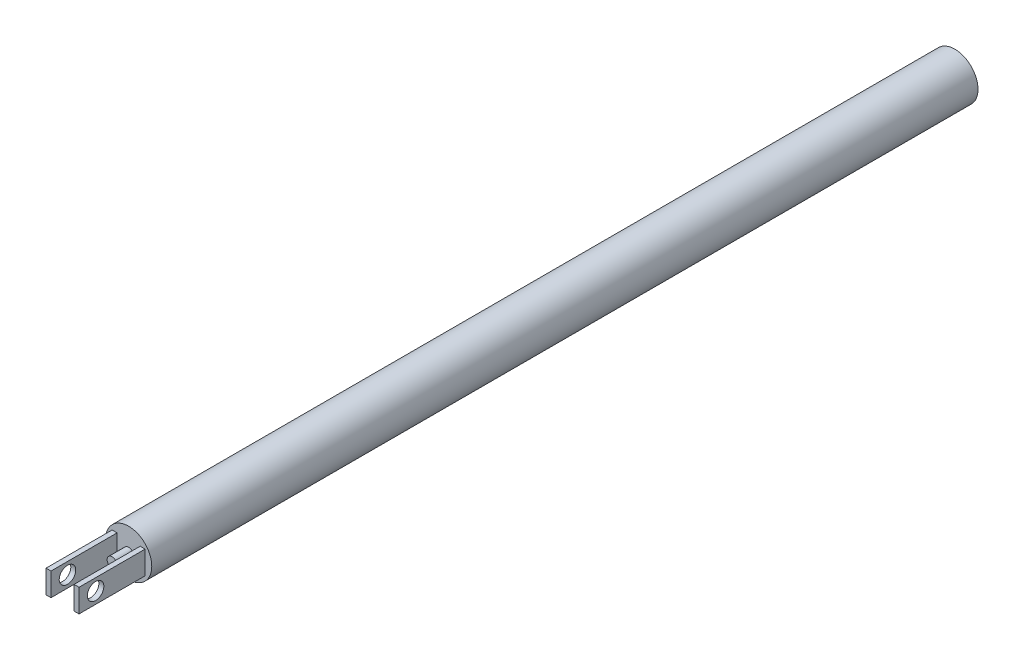
ISO-10303-21;
HEADER;
FILE_DESCRIPTION(('STEP AP214'),'2;1');
FILE_NAME('part.step','',(''),(''),'','','');
FILE_SCHEMA(('AUTOMOTIVE_DESIGN { 1 0 10303 214 1 1 1 1 }'));
ENDSEC;
DATA;
#1=APPLICATION_CONTEXT('core data for automotive mechanical design processes');
#2=APPLICATION_PROTOCOL_DEFINITION('international standard','automotive_design',2000,#1);
#3=PRODUCT_CONTEXT('',#1,'mechanical');
#4=PRODUCT('Part','Part','',(#3));
#5=PRODUCT_RELATED_PRODUCT_CATEGORY('part','',(#4));
#6=PRODUCT_DEFINITION_FORMATION('','',#4);
#7=PRODUCT_DEFINITION_CONTEXT('part definition',#1,'design');
#8=PRODUCT_DEFINITION('design','',#6,#7);
#9=PRODUCT_DEFINITION_SHAPE('','',#8);
#10=(LENGTH_UNIT() NAMED_UNIT(*) SI_UNIT(.MILLI.,.METRE.));
#11=(NAMED_UNIT(*) PLANE_ANGLE_UNIT() SI_UNIT($,.RADIAN.));
#12=(NAMED_UNIT(*) SI_UNIT($,.STERADIAN.) SOLID_ANGLE_UNIT());
#13=UNCERTAINTY_MEASURE_WITH_UNIT(LENGTH_MEASURE(1.E-05),#10,'distance_accuracy_value','');
#14=(GEOMETRIC_REPRESENTATION_CONTEXT(3) GLOBAL_UNCERTAINTY_ASSIGNED_CONTEXT((#13)) GLOBAL_UNIT_ASSIGNED_CONTEXT((#10,
#11,#12)) REPRESENTATION_CONTEXT('',''));
#15=CARTESIAN_POINT('',(0.,0.,0.));
#16=DIRECTION('',(0.,0.,1.));
#17=DIRECTION('',(1.,0.,0.));
#18=AXIS2_PLACEMENT_3D('',#15,#16,#17);
#19=CARTESIAN_POINT('',(-5.,-3.5,145.));
#20=DIRECTION('',(0.,0.,1.));
#21=DIRECTION('',(1.,0.,0.));
#22=AXIS2_PLACEMENT_3D('',#19,#20,#21);
#23=PLANE('',#22);
#24=DIRECTION('',(0.,1.,0.));
#25=VECTOR('',#24,1.);
#26=CARTESIAN_POINT('',(3.5,-3.5,145.));
#27=LINE('',#26,#25);
#28=CARTESIAN_POINT('',(3.5,-3.5,145.));
#29=VERTEX_POINT('',#28);
#30=CARTESIAN_POINT('',(3.5,3.5,145.));
#31=VERTEX_POINT('',#30);
#32=EDGE_CURVE('E101',#29,#31,#27,.T.);
#33=ORIENTED_EDGE('',*,*,#32,.F.);
#34=DIRECTION('',(1.,0.,0.));
#35=VECTOR('',#34,1.);
#36=CARTESIAN_POINT('',(-5.,-3.5,145.));
#37=LINE('',#36,#35);
#38=CARTESIAN_POINT('',(5.,-3.5,145.));
#39=VERTEX_POINT('',#38);
#40=EDGE_CURVE('E142',#29,#39,#37,.T.);
#41=ORIENTED_EDGE('',*,*,#40,.T.);
#42=DIRECTION('',(0.,-1.,0.));
#43=VECTOR('',#42,1.);
#44=CARTESIAN_POINT('',(5.,-3.5,145.));
#45=LINE('',#44,#43);
#46=CARTESIAN_POINT('',(5.,3.5,145.));
#47=VERTEX_POINT('',#46);
#48=EDGE_CURVE('E125',#47,#39,#45,.T.);
#49=ORIENTED_EDGE('',*,*,#48,.F.);
#50=DIRECTION('',(1.,0.,0.));
#51=VECTOR('',#50,1.);
#52=CARTESIAN_POINT('',(-5.,3.5,145.));
#53=LINE('',#52,#51);
#54=EDGE_CURVE('E118',#31,#47,#53,.T.);
#55=ORIENTED_EDGE('',*,*,#54,.F.);
#56=EDGE_LOOP('',(#33,#41,#49,#55));
#57=FACE_BOUND('',#56,.T.);
#58=ADVANCED_FACE('F33',(#57),#23,.T.);
#59=CARTESIAN_POINT('',(-5.,3.5,145.));
#60=DIRECTION('',(0.,1.,0.));
#61=DIRECTION('',(0.,0.,1.));
#62=AXIS2_PLACEMENT_3D('',#59,#60,#61);
#63=PLANE('',#62);
#64=DIRECTION('',(0.,0.,1.));
#65=VECTOR('',#64,1.);
#66=CARTESIAN_POINT('',(3.5,3.5,115.100505063388));
#67=LINE('',#66,#65);
#68=CARTESIAN_POINT('',(3.5,3.5,125.));
#69=VERTEX_POINT('',#68);
#70=EDGE_CURVE('E105',#69,#31,#67,.T.);
#71=ORIENTED_EDGE('',*,*,#70,.T.);
#72=ORIENTED_EDGE('',*,*,#54,.T.);
#73=DIRECTION('',(0.,0.,1.));
#74=VECTOR('',#73,1.);
#75=CARTESIAN_POINT('',(5.,3.5,145.));
#76=LINE('',#75,#74);
#77=CARTESIAN_POINT('',(5.,3.5,125.));
#78=VERTEX_POINT('',#77);
#79=EDGE_CURVE('E169',#78,#47,#76,.T.);
#80=ORIENTED_EDGE('',*,*,#79,.F.);
#81=DIRECTION('',(1.,0.,0.));
#82=VECTOR('',#81,1.);
#83=CARTESIAN_POINT('',(-5.,3.5,125.));
#84=LINE('',#83,#82);
#85=EDGE_CURVE('E120',#69,#78,#84,.T.);
#86=ORIENTED_EDGE('',*,*,#85,.F.);
#87=EDGE_LOOP('',(#71,#72,#80,#86));
#88=FACE_BOUND('',#87,.T.);
#89=ADVANCED_FACE('F116',(#88),#63,.T.);
#90=CARTESIAN_POINT('',(-5.,-3.5,145.));
#91=DIRECTION('',(0.,-1.,0.));
#92=DIRECTION('',(0.,0.,-1.));
#93=AXIS2_PLACEMENT_3D('',#90,#91,#92);
#94=PLANE('',#93);
#95=DIRECTION('',(0.,0.,1.));
#96=VECTOR('',#95,1.);
#97=CARTESIAN_POINT('',(3.5,-3.5,115.100505063388));
#98=LINE('',#97,#96);
#99=CARTESIAN_POINT('',(3.5,-3.5,125.));
#100=VERTEX_POINT('',#99);
#101=EDGE_CURVE('E108',#100,#29,#98,.T.);
#102=ORIENTED_EDGE('',*,*,#101,.F.);
#103=DIRECTION('',(1.,0.,0.));
#104=VECTOR('',#103,1.);
#105=CARTESIAN_POINT('',(-5.,-3.5,125.));
#106=LINE('',#105,#104);
#107=CARTESIAN_POINT('',(5.,-3.5,125.));
#108=VERTEX_POINT('',#107);
#109=EDGE_CURVE('E138',#100,#108,#106,.T.);
#110=ORIENTED_EDGE('',*,*,#109,.T.);
#111=DIRECTION('',(0.,0.,-1.));
#112=VECTOR('',#111,1.);
#113=CARTESIAN_POINT('',(5.,-3.5,145.));
#114=LINE('',#113,#112);
#115=EDGE_CURVE('E163',#39,#108,#114,.T.);
#116=ORIENTED_EDGE('',*,*,#115,.F.);
#117=ORIENTED_EDGE('',*,*,#40,.F.);
#118=EDGE_LOOP('',(#102,#110,#116,#117));
#119=FACE_BOUND('',#118,.T.);
#120=ADVANCED_FACE('F186',(#119),#94,.T.);
#121=CARTESIAN_POINT('',(-5.,0.,140.));
#122=DIRECTION('',(1.,0.,0.));
#123=DIRECTION('',(0.,0.,-1.));
#124=AXIS2_PLACEMENT_3D('',#121,#122,#123);
#125=CYLINDRICAL_SURFACE('',#124,2.5);
#126=CARTESIAN_POINT('',(3.5,0.,140.));
#127=DIRECTION('',(1.,0.,0.));
#128=DIRECTION('',(0.,0.,-1.));
#129=AXIS2_PLACEMENT_3D('',#126,#127,#128);
#130=CIRCLE('',#129,2.5);
#131=CARTESIAN_POINT('',(3.5,0.,137.5));
#132=VERTEX_POINT('',#131);
#133=EDGE_CURVE('E37',#132,#132,#130,.F.);
#134=ORIENTED_EDGE('',*,*,#133,.T.);
#135=EDGE_LOOP('',(#134));
#136=FACE_BOUND('',#135,.T.);
#137=CARTESIAN_POINT('',(5.,0.,140.));
#138=DIRECTION('',(1.,0.,0.));
#139=DIRECTION('',(0.,0.,-1.));
#140=AXIS2_PLACEMENT_3D('',#137,#138,#139);
#141=CIRCLE('',#140,2.5);
#142=CARTESIAN_POINT('',(5.,0.,137.5));
#143=VERTEX_POINT('',#142);
#144=EDGE_CURVE('E150',#143,#143,#141,.T.);
#145=ORIENTED_EDGE('',*,*,#144,.T.);
#146=EDGE_LOOP('',(#145));
#147=FACE_BOUND('',#146,.T.);
#148=ADVANCED_FACE('F196',(#136,#147),#125,.F.);
#149=CARTESIAN_POINT('',(0.,0.,125.));
#150=DIRECTION('',(0.,0.,1.));
#151=DIRECTION('',(1.,0.,0.));
#152=AXIS2_PLACEMENT_3D('',#149,#150,#151);
#153=PLANE('',#152);
#154=CARTESIAN_POINT('',(0.,0.,125.));
#155=DIRECTION('',(0.,0.,1.));
#156=DIRECTION('',(1.,0.,0.));
#157=AXIS2_PLACEMENT_3D('',#154,#155,#156);
#158=CIRCLE('',#157,1.5);
#159=CARTESIAN_POINT('',(1.5,0.,125.));
#160=VERTEX_POINT('',#159);
#161=EDGE_CURVE('E256',#160,#160,#158,.T.);
#162=ORIENTED_EDGE('',*,*,#161,.F.);
#163=EDGE_LOOP('',(#162));
#164=FACE_BOUND('',#163,.T.);
#165=DIRECTION('',(0.,-1.,0.));
#166=VECTOR('',#165,1.);
#167=CARTESIAN_POINT('',(3.5,-3.5,125.));
#168=LINE('',#167,#166);
#169=EDGE_CURVE('E146',#69,#100,#168,.T.);
#170=ORIENTED_EDGE('',*,*,#169,.F.);
#171=ORIENTED_EDGE('',*,*,#85,.T.);
#172=DIRECTION('',(0.,1.,0.));
#173=VECTOR('',#172,1.);
#174=CARTESIAN_POINT('',(5.,-3.5,125.));
#175=LINE('',#174,#173);
#176=EDGE_CURVE('E166',#108,#78,#175,.T.);
#177=ORIENTED_EDGE('',*,*,#176,.F.);
#178=ORIENTED_EDGE('',*,*,#109,.F.);
#179=EDGE_LOOP('',(#170,#171,#177,#178));
#180=FACE_BOUND('',#179,.T.);
#181=CARTESIAN_POINT('',(0.,0.,125.));
#182=DIRECTION('',(0.,0.,1.));
#183=DIRECTION('',(1.,0.,0.));
#184=AXIS2_PLACEMENT_3D('',#181,#182,#183);
#185=CIRCLE('',#184,7.);
#186=CARTESIAN_POINT('',(7.,0.,125.));
#187=VERTEX_POINT('',#186);
#188=EDGE_CURVE('E42',#187,#187,#185,.T.);
#189=ORIENTED_EDGE('',*,*,#188,.T.);
#190=EDGE_LOOP('',(#189));
#191=FACE_BOUND('',#190,.T.);
#192=DIRECTION('',(0.,1.,0.));
#193=VECTOR('',#192,1.);
#194=CARTESIAN_POINT('',(-5.,-3.5,125.));
#195=LINE('',#194,#193);
#196=CARTESIAN_POINT('',(-5.,-3.5,125.));
#197=VERTEX_POINT('',#196);
#198=CARTESIAN_POINT('',(-5.,3.5,125.));
#199=VERTEX_POINT('',#198);
#200=EDGE_CURVE('E179',#197,#199,#195,.T.);
#201=ORIENTED_EDGE('',*,*,#200,.T.);
#202=CARTESIAN_POINT('',(-3.5,3.5,125.));
#203=VERTEX_POINT('',#202);
#204=EDGE_CURVE('E127',#199,#203,#84,.T.);
#205=ORIENTED_EDGE('',*,*,#204,.T.);
#206=DIRECTION('',(0.,1.,0.));
#207=VECTOR('',#206,1.);
#208=CARTESIAN_POINT('',(-3.5,-3.5,125.));
#209=LINE('',#208,#207);
#210=CARTESIAN_POINT('',(-3.5,-3.5,125.));
#211=VERTEX_POINT('',#210);
#212=EDGE_CURVE('E151',#211,#203,#209,.T.);
#213=ORIENTED_EDGE('',*,*,#212,.F.);
#214=EDGE_CURVE('E135',#197,#211,#106,.T.);
#215=ORIENTED_EDGE('',*,*,#214,.F.);
#216=EDGE_LOOP('',(#201,#205,#213,#215));
#217=FACE_BOUND('',#216,.T.);
#218=ADVANCED_FACE('F193',(#164,#180,#191,#217),#153,.T.);
#219=CARTESIAN_POINT('',(0.,0.,-125.));
#220=DIRECTION('',(0.,0.,1.));
#221=DIRECTION('',(1.,0.,0.));
#222=AXIS2_PLACEMENT_3D('',#219,#220,#221);
#223=CYLINDRICAL_SURFACE('',#222,7.);
#224=CARTESIAN_POINT('',(0.,0.,-125.));
#225=DIRECTION('',(0.,0.,1.));
#226=DIRECTION('',(1.,0.,0.));
#227=AXIS2_PLACEMENT_3D('',#224,#225,#226);
#228=CIRCLE('',#227,7.);
#229=CARTESIAN_POINT('',(7.,0.,-125.));
#230=VERTEX_POINT('',#229);
#231=EDGE_CURVE('E11',#230,#230,#228,.T.);
#232=ORIENTED_EDGE('',*,*,#231,.T.);
#233=EDGE_LOOP('',(#232));
#234=FACE_BOUND('',#233,.T.);
#235=ORIENTED_EDGE('',*,*,#188,.F.);
#236=EDGE_LOOP('',(#235));
#237=FACE_BOUND('',#236,.T.);
#238=ADVANCED_FACE('F35',(#234,#237),#223,.T.);
#239=CARTESIAN_POINT('',(0.,0.,-125.));
#240=DIRECTION('',(0.,0.,1.));
#241=DIRECTION('',(1.,0.,0.));
#242=AXIS2_PLACEMENT_3D('',#239,#240,#241);
#243=PLANE('',#242);
#244=ORIENTED_EDGE('',*,*,#231,.F.);
#245=EDGE_LOOP('',(#244));
#246=FACE_BOUND('',#245,.T.);
#247=ADVANCED_FACE('F202',(#246),#243,.F.);
#248=DIRECTION('',(0.,-1.,0.));
#249=VECTOR('',#248,1.);
#250=CARTESIAN_POINT('',(-3.5,-3.5,145.));
#251=LINE('',#250,#249);
#252=CARTESIAN_POINT('',(-3.5,3.5,145.));
#253=VERTEX_POINT('',#252);
#254=CARTESIAN_POINT('',(-3.5,-3.5,145.));
#255=VERTEX_POINT('',#254);
#256=EDGE_CURVE('E112',#253,#255,#251,.T.);
#257=ORIENTED_EDGE('',*,*,#256,.F.);
#258=CARTESIAN_POINT('',(-5.,3.5,145.));
#259=VERTEX_POINT('',#258);
#260=EDGE_CURVE('E126',#259,#253,#53,.T.);
#261=ORIENTED_EDGE('',*,*,#260,.F.);
#262=DIRECTION('',(0.,-1.,0.));
#263=VECTOR('',#262,1.);
#264=CARTESIAN_POINT('',(-5.,-3.5,145.));
#265=LINE('',#264,#263);
#266=CARTESIAN_POINT('',(-5.,-3.5,145.));
#267=VERTEX_POINT('',#266);
#268=EDGE_CURVE('E174',#259,#267,#265,.T.);
#269=ORIENTED_EDGE('',*,*,#268,.T.);
#270=EDGE_CURVE('E139',#267,#255,#37,.T.);
#271=ORIENTED_EDGE('',*,*,#270,.T.);
#272=EDGE_LOOP('',(#257,#261,#269,#271));
#273=FACE_BOUND('',#272,.T.);
#274=ADVANCED_FACE('F207',(#273),#23,.T.);
#275=DIRECTION('',(0.,0.,1.));
#276=VECTOR('',#275,1.);
#277=CARTESIAN_POINT('',(-3.5,3.5,115.100505063388));
#278=LINE('',#277,#276);
#279=EDGE_CURVE('E121',#203,#253,#278,.T.);
#280=ORIENTED_EDGE('',*,*,#279,.F.);
#281=ORIENTED_EDGE('',*,*,#204,.F.);
#282=DIRECTION('',(0.,0.,1.));
#283=VECTOR('',#282,1.);
#284=CARTESIAN_POINT('',(-5.,3.5,145.));
#285=LINE('',#284,#283);
#286=EDGE_CURVE('E58',#199,#259,#285,.T.);
#287=ORIENTED_EDGE('',*,*,#286,.T.);
#288=ORIENTED_EDGE('',*,*,#260,.T.);
#289=EDGE_LOOP('',(#280,#281,#287,#288));
#290=FACE_BOUND('',#289,.T.);
#291=ADVANCED_FACE('F215',(#290),#63,.T.);
#292=DIRECTION('',(0.,0.,1.));
#293=VECTOR('',#292,1.);
#294=CARTESIAN_POINT('',(-3.5,-3.5,115.100505063388));
#295=LINE('',#294,#293);
#296=EDGE_CURVE('E50',#211,#255,#295,.T.);
#297=ORIENTED_EDGE('',*,*,#296,.T.);
#298=ORIENTED_EDGE('',*,*,#270,.F.);
#299=DIRECTION('',(0.,0.,-1.));
#300=VECTOR('',#299,1.);
#301=CARTESIAN_POINT('',(-5.,-3.5,145.));
#302=LINE('',#301,#300);
#303=EDGE_CURVE('E177',#267,#197,#302,.T.);
#304=ORIENTED_EDGE('',*,*,#303,.T.);
#305=ORIENTED_EDGE('',*,*,#214,.T.);
#306=EDGE_LOOP('',(#297,#298,#304,#305));
#307=FACE_BOUND('',#306,.T.);
#308=ADVANCED_FACE('F222',(#307),#94,.T.);
#309=CARTESIAN_POINT('',(-5.,0.,0.));
#310=DIRECTION('',(-1.,0.,0.));
#311=DIRECTION('',(0.,0.,1.));
#312=AXIS2_PLACEMENT_3D('',#309,#310,#311);
#313=PLANE('',#312);
#314=CARTESIAN_POINT('',(-5.,0.,140.));
#315=DIRECTION('',(1.,0.,0.));
#316=DIRECTION('',(0.,0.,-1.));
#317=AXIS2_PLACEMENT_3D('',#314,#315,#316);
#318=CIRCLE('',#317,2.5);
#319=CARTESIAN_POINT('',(-5.,0.,137.5));
#320=VERTEX_POINT('',#319);
#321=EDGE_CURVE('E171',#320,#320,#318,.T.);
#322=ORIENTED_EDGE('',*,*,#321,.T.);
#323=EDGE_LOOP('',(#322));
#324=FACE_BOUND('',#323,.T.);
#325=ORIENTED_EDGE('',*,*,#268,.F.);
#326=ORIENTED_EDGE('',*,*,#286,.F.);
#327=ORIENTED_EDGE('',*,*,#200,.F.);
#328=ORIENTED_EDGE('',*,*,#303,.F.);
#329=EDGE_LOOP('',(#325,#326,#327,#328));
#330=FACE_BOUND('',#329,.T.);
#331=ADVANCED_FACE('F227',(#324,#330),#313,.T.);
#332=CARTESIAN_POINT('',(-3.5,0.,140.));
#333=DIRECTION('',(-1.,0.,0.));
#334=DIRECTION('',(0.,-1.,0.));
#335=AXIS2_PLACEMENT_3D('',#332,#333,#334);
#336=CIRCLE('',#335,2.5);
#337=CARTESIAN_POINT('',(-3.5,-2.5,140.));
#338=VERTEX_POINT('',#337);
#339=EDGE_CURVE('E144',#338,#338,#336,.F.);
#340=ORIENTED_EDGE('',*,*,#339,.T.);
#341=EDGE_LOOP('',(#340));
#342=FACE_BOUND('',#341,.T.);
#343=ORIENTED_EDGE('',*,*,#321,.F.);
#344=EDGE_LOOP('',(#343));
#345=FACE_BOUND('',#344,.T.);
#346=ADVANCED_FACE('F229',(#342,#345),#125,.F.);
#347=CARTESIAN_POINT('',(5.,0.,0.));
#348=DIRECTION('',(-1.,0.,0.));
#349=DIRECTION('',(0.,0.,1.));
#350=AXIS2_PLACEMENT_3D('',#347,#348,#349);
#351=PLANE('',#350);
#352=ORIENTED_EDGE('',*,*,#48,.T.);
#353=ORIENTED_EDGE('',*,*,#115,.T.);
#354=ORIENTED_EDGE('',*,*,#176,.T.);
#355=ORIENTED_EDGE('',*,*,#79,.T.);
#356=EDGE_LOOP('',(#352,#353,#354,#355));
#357=FACE_BOUND('',#356,.T.);
#358=ORIENTED_EDGE('',*,*,#144,.F.);
#359=EDGE_LOOP('',(#358));
#360=FACE_BOUND('',#359,.T.);
#361=ADVANCED_FACE('F190',(#357,#360),#351,.F.);
#362=CARTESIAN_POINT('',(3.5,-3.5,115.100505063388));
#363=DIRECTION('',(1.,0.,0.));
#364=DIRECTION('',(0.,0.,-1.));
#365=AXIS2_PLACEMENT_3D('',#362,#363,#364);
#366=PLANE('',#365);
#367=ORIENTED_EDGE('',*,*,#169,.T.);
#368=ORIENTED_EDGE('',*,*,#101,.T.);
#369=ORIENTED_EDGE('',*,*,#32,.T.);
#370=ORIENTED_EDGE('',*,*,#70,.F.);
#371=EDGE_LOOP('',(#367,#368,#369,#370));
#372=FACE_BOUND('',#371,.T.);
#373=ORIENTED_EDGE('',*,*,#133,.F.);
#374=EDGE_LOOP('',(#373));
#375=FACE_BOUND('',#374,.T.);
#376=ADVANCED_FACE('F103',(#372,#375),#366,.F.);
#377=CARTESIAN_POINT('',(-3.5,-3.5,115.100505063388));
#378=DIRECTION('',(-1.,0.,0.));
#379=DIRECTION('',(0.,-1.,0.));
#380=AXIS2_PLACEMENT_3D('',#377,#378,#379);
#381=PLANE('',#380);
#382=ORIENTED_EDGE('',*,*,#212,.T.);
#383=ORIENTED_EDGE('',*,*,#279,.T.);
#384=ORIENTED_EDGE('',*,*,#256,.T.);
#385=ORIENTED_EDGE('',*,*,#296,.F.);
#386=EDGE_LOOP('',(#382,#383,#384,#385));
#387=FACE_BOUND('',#386,.T.);
#388=ORIENTED_EDGE('',*,*,#339,.F.);
#389=EDGE_LOOP('',(#388));
#390=FACE_BOUND('',#389,.T.);
#391=ADVANCED_FACE('F242',(#387,#390),#381,.F.);
#392=CARTESIAN_POINT('',(0.,0.,130.));
#393=DIRECTION('',(0.,0.,-1.));
#394=DIRECTION('',(-1.,0.,0.));
#395=AXIS2_PLACEMENT_3D('',#392,#393,#394);
#396=CYLINDRICAL_SURFACE('',#395,1.5);
#397=CARTESIAN_POINT('',(0.,0.,130.));
#398=DIRECTION('',(0.,0.,1.));
#399=DIRECTION('',(1.,0.,0.));
#400=AXIS2_PLACEMENT_3D('',#397,#398,#399);
#401=CIRCLE('',#400,1.5);
#402=CARTESIAN_POINT('',(1.5,0.,130.));
#403=VERTEX_POINT('',#402);
#404=EDGE_CURVE('E113',#403,#403,#401,.T.);
#405=ORIENTED_EDGE('',*,*,#404,.F.);
#406=EDGE_LOOP('',(#405));
#407=FACE_BOUND('',#406,.T.);
#408=ORIENTED_EDGE('',*,*,#161,.T.);
#409=EDGE_LOOP('',(#408));
#410=FACE_BOUND('',#409,.T.);
#411=ADVANCED_FACE('F245',(#407,#410),#396,.T.);
#412=CARTESIAN_POINT('',(0.,0.,130.));
#413=DIRECTION('',(0.,0.,1.));
#414=DIRECTION('',(1.,0.,0.));
#415=AXIS2_PLACEMENT_3D('',#412,#413,#414);
#416=PLANE('',#415);
#417=ORIENTED_EDGE('',*,*,#404,.T.);
#418=EDGE_LOOP('',(#417));
#419=FACE_BOUND('',#418,.T.);
#420=ADVANCED_FACE('F248',(#419),#416,.T.);
#421=CLOSED_SHELL('',(#58,#89,#120,#148,#218,#238,#247,#274,#291,#308,#331,#346,#361,#376,#391,
#411,#420));
#422=MANIFOLD_SOLID_BREP('B2',#421);
#423=ADVANCED_BREP_SHAPE_REPRESENTATION('',(#18,#422),#14);
#424=SHAPE_DEFINITION_REPRESENTATION(#9,#423);
ENDSEC;
END-ISO-10303-21;
